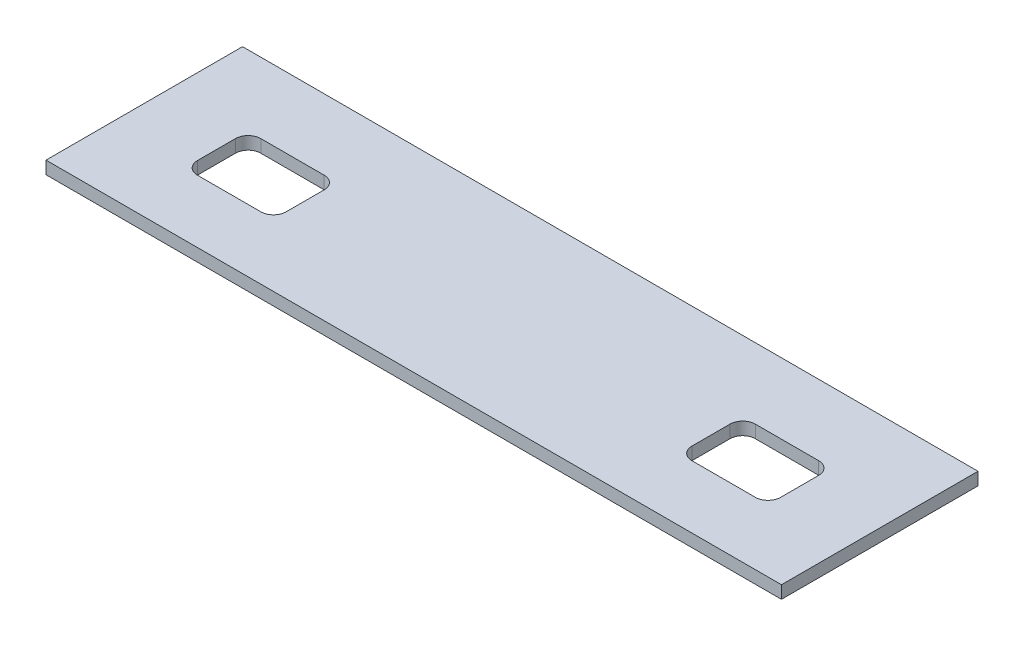
ISO-10303-21;
HEADER;
FILE_DESCRIPTION(('STEP AP214'),'2;1');
FILE_NAME('part.step','',(''),(''),'','','');
FILE_SCHEMA(('AUTOMOTIVE_DESIGN { 1 0 10303 214 1 1 1 1 }'));
ENDSEC;
DATA;
#1=APPLICATION_CONTEXT('core data for automotive mechanical design processes');
#2=APPLICATION_PROTOCOL_DEFINITION('international standard','automotive_design',2000,#1);
#3=PRODUCT_CONTEXT('',#1,'mechanical');
#4=PRODUCT('Part','Part','',(#3));
#5=PRODUCT_RELATED_PRODUCT_CATEGORY('part','',(#4));
#6=PRODUCT_DEFINITION_FORMATION('','',#4);
#7=PRODUCT_DEFINITION_CONTEXT('part definition',#1,'design');
#8=PRODUCT_DEFINITION('design','',#6,#7);
#9=PRODUCT_DEFINITION_SHAPE('','',#8);
#10=(LENGTH_UNIT() NAMED_UNIT(*) SI_UNIT(.MILLI.,.METRE.));
#11=(NAMED_UNIT(*) PLANE_ANGLE_UNIT() SI_UNIT($,.RADIAN.));
#12=(NAMED_UNIT(*) SI_UNIT($,.STERADIAN.) SOLID_ANGLE_UNIT());
#13=UNCERTAINTY_MEASURE_WITH_UNIT(LENGTH_MEASURE(1.E-05),#10,'distance_accuracy_value','');
#14=(GEOMETRIC_REPRESENTATION_CONTEXT(3) GLOBAL_UNCERTAINTY_ASSIGNED_CONTEXT((#13)) GLOBAL_UNIT_ASSIGNED_CONTEXT((#10,
#11,#12)) REPRESENTATION_CONTEXT('',''));
#15=CARTESIAN_POINT('',(0.,0.,0.));
#16=DIRECTION('',(0.,0.,1.));
#17=DIRECTION('',(1.,0.,0.));
#18=AXIS2_PLACEMENT_3D('',#15,#16,#17);
#19=CARTESIAN_POINT('',(0.,10.,0.));
#20=DIRECTION('',(1.,0.,0.));
#21=DIRECTION('',(0.,0.,-1.));
#22=AXIS2_PLACEMENT_3D('',#19,#20,#21);
#23=PLANE('',#22);
#24=DIRECTION('',(0.,0.,1.));
#25=VECTOR('',#24,1.);
#26=CARTESIAN_POINT('',(0.,0.,0.));
#27=LINE('',#26,#25);
#28=CARTESIAN_POINT('',(0.,0.,-155.));
#29=VERTEX_POINT('',#28);
#30=CARTESIAN_POINT('',(0.,0.,0.));
#31=VERTEX_POINT('',#30);
#32=EDGE_CURVE('E288',#29,#31,#27,.T.);
#33=ORIENTED_EDGE('',*,*,#32,.T.);
#34=DIRECTION('',(0.,-1.,0.));
#35=VECTOR('',#34,1.);
#36=CARTESIAN_POINT('',(0.,10.,0.));
#37=LINE('',#36,#35);
#38=CARTESIAN_POINT('',(0.,10.,0.));
#39=VERTEX_POINT('',#38);
#40=EDGE_CURVE('E11',#39,#31,#37,.T.);
#41=ORIENTED_EDGE('',*,*,#40,.F.);
#42=DIRECTION('',(0.,0.,1.));
#43=VECTOR('',#42,1.);
#44=CARTESIAN_POINT('',(0.,10.,0.));
#45=LINE('',#44,#43);
#46=CARTESIAN_POINT('',(0.,10.,-155.));
#47=VERTEX_POINT('',#46);
#48=EDGE_CURVE('E303',#47,#39,#45,.T.);
#49=ORIENTED_EDGE('',*,*,#48,.F.);
#50=DIRECTION('',(0.,-1.,0.));
#51=VECTOR('',#50,1.);
#52=CARTESIAN_POINT('',(0.,10.,-155.));
#53=LINE('',#52,#51);
#54=EDGE_CURVE('E313',#47,#29,#53,.T.);
#55=ORIENTED_EDGE('',*,*,#54,.T.);
#56=EDGE_LOOP('',(#33,#41,#49,#55));
#57=FACE_BOUND('',#56,.T.);
#58=ADVANCED_FACE('F34',(#57),#23,.F.);
#59=CARTESIAN_POINT('',(0.,10.,0.));
#60=DIRECTION('',(0.,0.,-1.));
#61=DIRECTION('',(-1.,0.,0.));
#62=AXIS2_PLACEMENT_3D('',#59,#60,#61);
#63=PLANE('',#62);
#64=DIRECTION('',(1.,0.,0.));
#65=VECTOR('',#64,1.);
#66=CARTESIAN_POINT('',(0.,0.,0.));
#67=LINE('',#66,#65);
#68=CARTESIAN_POINT('',(580.,0.,0.));
#69=VERTEX_POINT('',#68);
#70=EDGE_CURVE('E316',#31,#69,#67,.T.);
#71=ORIENTED_EDGE('',*,*,#70,.T.);
#72=DIRECTION('',(0.,-1.,0.));
#73=VECTOR('',#72,1.);
#74=CARTESIAN_POINT('',(580.,10.,0.));
#75=LINE('',#74,#73);
#76=CARTESIAN_POINT('',(580.,10.,0.));
#77=VERTEX_POINT('',#76);
#78=EDGE_CURVE('E41',#77,#69,#75,.T.);
#79=ORIENTED_EDGE('',*,*,#78,.F.);
#80=DIRECTION('',(1.,0.,0.));
#81=VECTOR('',#80,1.);
#82=CARTESIAN_POINT('',(0.,10.,0.));
#83=LINE('',#82,#81);
#84=EDGE_CURVE('E306',#39,#77,#83,.T.);
#85=ORIENTED_EDGE('',*,*,#84,.F.);
#86=ORIENTED_EDGE('',*,*,#40,.T.);
#87=EDGE_LOOP('',(#71,#79,#85,#86));
#88=FACE_BOUND('',#87,.T.);
#89=ADVANCED_FACE('F345',(#88),#63,.F.);
#90=CARTESIAN_POINT('',(580.,10.,0.));
#91=DIRECTION('',(-1.,0.,0.));
#92=DIRECTION('',(0.,0.,1.));
#93=AXIS2_PLACEMENT_3D('',#90,#91,#92);
#94=PLANE('',#93);
#95=DIRECTION('',(0.,0.,-1.));
#96=VECTOR('',#95,1.);
#97=CARTESIAN_POINT('',(580.,0.,0.));
#98=LINE('',#97,#96);
#99=CARTESIAN_POINT('',(580.,0.,-155.));
#100=VERTEX_POINT('',#99);
#101=EDGE_CURVE('E318',#69,#100,#98,.T.);
#102=ORIENTED_EDGE('',*,*,#101,.T.);
#103=DIRECTION('',(0.,-1.,0.));
#104=VECTOR('',#103,1.);
#105=CARTESIAN_POINT('',(580.,10.,-155.));
#106=LINE('',#105,#104);
#107=CARTESIAN_POINT('',(580.,10.,-155.));
#108=VERTEX_POINT('',#107);
#109=EDGE_CURVE('E323',#108,#100,#106,.T.);
#110=ORIENTED_EDGE('',*,*,#109,.F.);
#111=DIRECTION('',(0.,0.,-1.));
#112=VECTOR('',#111,1.);
#113=CARTESIAN_POINT('',(580.,10.,0.));
#114=LINE('',#113,#112);
#115=EDGE_CURVE('E309',#77,#108,#114,.T.);
#116=ORIENTED_EDGE('',*,*,#115,.F.);
#117=ORIENTED_EDGE('',*,*,#78,.T.);
#118=EDGE_LOOP('',(#102,#110,#116,#117));
#119=FACE_BOUND('',#118,.T.);
#120=ADVANCED_FACE('F330',(#119),#94,.F.);
#121=CARTESIAN_POINT('',(0.,10.,-155.));
#122=DIRECTION('',(0.,0.,1.));
#123=DIRECTION('',(1.,0.,0.));
#124=AXIS2_PLACEMENT_3D('',#121,#122,#123);
#125=PLANE('',#124);
#126=DIRECTION('',(-1.,0.,0.));
#127=VECTOR('',#126,1.);
#128=CARTESIAN_POINT('',(0.,0.,-155.));
#129=LINE('',#128,#127);
#130=EDGE_CURVE('E307',#100,#29,#129,.T.);
#131=ORIENTED_EDGE('',*,*,#130,.T.);
#132=ORIENTED_EDGE('',*,*,#54,.F.);
#133=DIRECTION('',(-1.,0.,0.));
#134=VECTOR('',#133,1.);
#135=CARTESIAN_POINT('',(0.,10.,-155.));
#136=LINE('',#135,#134);
#137=EDGE_CURVE('E311',#108,#47,#136,.T.);
#138=ORIENTED_EDGE('',*,*,#137,.F.);
#139=ORIENTED_EDGE('',*,*,#109,.T.);
#140=EDGE_LOOP('',(#131,#132,#138,#139));
#141=FACE_BOUND('',#140,.T.);
#142=ADVANCED_FACE('F338',(#141),#125,.F.);
#143=CARTESIAN_POINT('',(0.,10.,0.));
#144=DIRECTION('',(0.,-1.,0.));
#145=DIRECTION('',(0.,0.,-1.));
#146=AXIS2_PLACEMENT_3D('',#143,#144,#145);
#147=PLANE('',#146);
#148=DIRECTION('',(-1.,0.,0.));
#149=VECTOR('',#148,1.);
#150=CARTESIAN_POINT('',(70.0000000000006,10.,-99.4058928691466));
#151=LINE('',#150,#149);
#152=CARTESIAN_POINT('',(120.000000000001,10.,-99.4058928691466));
#153=VERTEX_POINT('',#152);
#154=CARTESIAN_POINT('',(70.0000000000006,10.,-99.4058928691466));
#155=VERTEX_POINT('',#154);
#156=EDGE_CURVE('E209',#153,#155,#151,.T.);
#157=ORIENTED_EDGE('',*,*,#156,.F.);
#158=CARTESIAN_POINT('',(120.000000000001,10.,-89.4058928691466));
#159=DIRECTION('',(0.,1.,0.));
#160=DIRECTION('',(0.,0.,-1.));
#161=AXIS2_PLACEMENT_3D('',#158,#159,#160);
#162=CIRCLE('',#161,9.99999999999999);
#163=CARTESIAN_POINT('',(130.000000000001,10.,-89.4058928691466));
#164=VERTEX_POINT('',#163);
#165=EDGE_CURVE('E48',#164,#153,#162,.T.);
#166=ORIENTED_EDGE('',*,*,#165,.F.);
#167=DIRECTION('',(0.,0.,-1.));
#168=VECTOR('',#167,1.);
#169=CARTESIAN_POINT('',(130.000000000001,10.,-89.4058928691466));
#170=LINE('',#169,#168);
#171=CARTESIAN_POINT('',(130.000000000001,10.,-59.4058928691466));
#172=VERTEX_POINT('',#171);
#173=EDGE_CURVE('E189',#172,#164,#170,.T.);
#174=ORIENTED_EDGE('',*,*,#173,.F.);
#175=CARTESIAN_POINT('',(120.000000000001,10.,-59.4058928691466));
#176=DIRECTION('',(0.,1.,0.));
#177=DIRECTION('',(0.,0.,-1.));
#178=AXIS2_PLACEMENT_3D('',#175,#176,#177);
#179=CIRCLE('',#178,9.99999999999999);
#180=CARTESIAN_POINT('',(120.000000000001,10.,-49.4058928691466));
#181=VERTEX_POINT('',#180);
#182=EDGE_CURVE('E192',#181,#172,#179,.T.);
#183=ORIENTED_EDGE('',*,*,#182,.F.);
#184=DIRECTION('',(1.,0.,0.));
#185=VECTOR('',#184,1.);
#186=CARTESIAN_POINT('',(70.0000000000006,10.,-49.4058928691466));
#187=LINE('',#186,#185);
#188=CARTESIAN_POINT('',(70.0000000000006,10.,-49.4058928691466));
#189=VERTEX_POINT('',#188);
#190=EDGE_CURVE('E220',#189,#181,#187,.T.);
#191=ORIENTED_EDGE('',*,*,#190,.F.);
#192=CARTESIAN_POINT('',(70.0000000000006,10.,-59.4058928691466));
#193=DIRECTION('',(0.,1.,0.));
#194=DIRECTION('',(0.,0.,-1.));
#195=AXIS2_PLACEMENT_3D('',#192,#193,#194);
#196=CIRCLE('',#195,10.);
#197=CARTESIAN_POINT('',(60.0000000000006,10.,-59.4058928691466));
#198=VERTEX_POINT('',#197);
#199=EDGE_CURVE('E217',#198,#189,#196,.T.);
#200=ORIENTED_EDGE('',*,*,#199,.F.);
#201=DIRECTION('',(0.,0.,1.));
#202=VECTOR('',#201,1.);
#203=CARTESIAN_POINT('',(60.0000000000006,10.,-89.4058928691466));
#204=LINE('',#203,#202);
#205=CARTESIAN_POINT('',(60.0000000000006,10.,-89.4058928691466));
#206=VERTEX_POINT('',#205);
#207=EDGE_CURVE('E214',#206,#198,#204,.T.);
#208=ORIENTED_EDGE('',*,*,#207,.F.);
#209=CARTESIAN_POINT('',(70.0000000000006,10.,-89.4058928691466));
#210=DIRECTION('',(0.,1.,0.));
#211=DIRECTION('',(0.,0.,-1.));
#212=AXIS2_PLACEMENT_3D('',#209,#210,#211);
#213=CIRCLE('',#212,10.);
#214=EDGE_CURVE('E211',#155,#206,#213,.T.);
#215=ORIENTED_EDGE('',*,*,#214,.F.);
#216=EDGE_LOOP('',(#157,#166,#174,#183,#191,#200,#208,#215));
#217=FACE_BOUND('',#216,.T.);
#218=DIRECTION('',(-1.,0.,0.));
#219=VECTOR('',#218,1.);
#220=CARTESIAN_POINT('',(460.000000000001,10.,-99.4058928691465));
#221=LINE('',#220,#219);
#222=CARTESIAN_POINT('',(510.000000000001,10.,-99.4058928691465));
#223=VERTEX_POINT('',#222);
#224=CARTESIAN_POINT('',(460.000000000001,10.,-99.4058928691465));
#225=VERTEX_POINT('',#224);
#226=EDGE_CURVE('E266',#223,#225,#221,.T.);
#227=ORIENTED_EDGE('',*,*,#226,.F.);
#228=CARTESIAN_POINT('',(510.000000000001,10.,-89.4058928691465));
#229=DIRECTION('',(0.,1.,0.));
#230=DIRECTION('',(0.,0.,-1.));
#231=AXIS2_PLACEMENT_3D('',#228,#229,#230);
#232=CIRCLE('',#231,10.);
#233=CARTESIAN_POINT('',(520.000000000001,10.,-89.4058928691465));
#234=VERTEX_POINT('',#233);
#235=EDGE_CURVE('E227',#234,#223,#232,.T.);
#236=ORIENTED_EDGE('',*,*,#235,.F.);
#237=DIRECTION('',(0.,0.,-1.));
#238=VECTOR('',#237,1.);
#239=CARTESIAN_POINT('',(520.000000000001,10.,-89.4058928691465));
#240=LINE('',#239,#238);
#241=CARTESIAN_POINT('',(520.000000000001,10.,-59.4058928691465));
#242=VERTEX_POINT('',#241);
#243=EDGE_CURVE('E243',#242,#234,#240,.T.);
#244=ORIENTED_EDGE('',*,*,#243,.F.);
#245=CARTESIAN_POINT('',(510.000000000001,10.,-59.4058928691465));
#246=DIRECTION('',(0.,1.,0.));
#247=DIRECTION('',(0.,0.,-1.));
#248=AXIS2_PLACEMENT_3D('',#245,#246,#247);
#249=CIRCLE('',#248,10.);
#250=CARTESIAN_POINT('',(510.000000000001,10.,-49.4058928691465));
#251=VERTEX_POINT('',#250);
#252=EDGE_CURVE('E281',#251,#242,#249,.T.);
#253=ORIENTED_EDGE('',*,*,#252,.F.);
#254=DIRECTION('',(1.,0.,0.));
#255=VECTOR('',#254,1.);
#256=CARTESIAN_POINT('',(460.000000000001,10.,-49.4058928691465));
#257=LINE('',#256,#255);
#258=CARTESIAN_POINT('',(460.000000000001,10.,-49.4058928691465));
#259=VERTEX_POINT('',#258);
#260=EDGE_CURVE('E278',#259,#251,#257,.T.);
#261=ORIENTED_EDGE('',*,*,#260,.F.);
#262=CARTESIAN_POINT('',(460.000000000001,10.,-59.4058928691465));
#263=DIRECTION('',(0.,1.,0.));
#264=DIRECTION('',(0.,0.,-1.));
#265=AXIS2_PLACEMENT_3D('',#262,#263,#264);
#266=CIRCLE('',#265,10.);
#267=CARTESIAN_POINT('',(450.000000000001,10.,-59.4058928691465));
#268=VERTEX_POINT('',#267);
#269=EDGE_CURVE('E275',#268,#259,#266,.T.);
#270=ORIENTED_EDGE('',*,*,#269,.F.);
#271=DIRECTION('',(0.,0.,1.));
#272=VECTOR('',#271,1.);
#273=CARTESIAN_POINT('',(450.000000000001,10.,-89.4058928691465));
#274=LINE('',#273,#272);
#275=CARTESIAN_POINT('',(450.000000000001,10.,-89.4058928691465));
#276=VERTEX_POINT('',#275);
#277=EDGE_CURVE('E272',#276,#268,#274,.T.);
#278=ORIENTED_EDGE('',*,*,#277,.F.);
#279=CARTESIAN_POINT('',(460.000000000001,10.,-89.4058928691465));
#280=DIRECTION('',(0.,1.,0.));
#281=DIRECTION('',(0.,0.,-1.));
#282=AXIS2_PLACEMENT_3D('',#279,#280,#281);
#283=CIRCLE('',#282,10.);
#284=EDGE_CURVE('E269',#225,#276,#283,.T.);
#285=ORIENTED_EDGE('',*,*,#284,.F.);
#286=EDGE_LOOP('',(#227,#236,#244,#253,#261,#270,#278,#285));
#287=FACE_BOUND('',#286,.T.);
#288=ORIENTED_EDGE('',*,*,#48,.T.);
#289=ORIENTED_EDGE('',*,*,#84,.T.);
#290=ORIENTED_EDGE('',*,*,#115,.T.);
#291=ORIENTED_EDGE('',*,*,#137,.T.);
#292=EDGE_LOOP('',(#288,#289,#290,#291));
#293=FACE_BOUND('',#292,.T.);
#294=ADVANCED_FACE('F344',(#217,#287,#293),#147,.F.);
#295=CARTESIAN_POINT('',(0.,0.,0.));
#296=DIRECTION('',(0.,-1.,0.));
#297=DIRECTION('',(0.,0.,-1.));
#298=AXIS2_PLACEMENT_3D('',#295,#296,#297);
#299=PLANE('',#298);
#300=CARTESIAN_POINT('',(120.000000000001,0.,-89.4058928691466));
#301=DIRECTION('',(0.,1.,0.));
#302=DIRECTION('',(0.,0.,-1.));
#303=AXIS2_PLACEMENT_3D('',#300,#301,#302);
#304=CIRCLE('',#303,9.99999999999999);
#305=CARTESIAN_POINT('',(130.000000000001,0.,-89.4058928691466));
#306=VERTEX_POINT('',#305);
#307=CARTESIAN_POINT('',(120.000000000001,0.,-99.4058928691466));
#308=VERTEX_POINT('',#307);
#309=EDGE_CURVE('E172',#306,#308,#304,.T.);
#310=ORIENTED_EDGE('',*,*,#309,.T.);
#311=DIRECTION('',(-1.,0.,0.));
#312=VECTOR('',#311,1.);
#313=CARTESIAN_POINT('',(70.0000000000006,0.,-99.4058928691466));
#314=LINE('',#313,#312);
#315=CARTESIAN_POINT('',(70.0000000000006,0.,-99.4058928691466));
#316=VERTEX_POINT('',#315);
#317=EDGE_CURVE('E181',#308,#316,#314,.T.);
#318=ORIENTED_EDGE('',*,*,#317,.T.);
#319=CARTESIAN_POINT('',(70.0000000000006,0.,-89.4058928691466));
#320=DIRECTION('',(0.,1.,0.));
#321=DIRECTION('',(0.,0.,-1.));
#322=AXIS2_PLACEMENT_3D('',#319,#320,#321);
#323=CIRCLE('',#322,10.);
#324=CARTESIAN_POINT('',(60.0000000000006,0.,-89.4058928691466));
#325=VERTEX_POINT('',#324);
#326=EDGE_CURVE('E56',#316,#325,#323,.T.);
#327=ORIENTED_EDGE('',*,*,#326,.T.);
#328=DIRECTION('',(0.,0.,1.));
#329=VECTOR('',#328,1.);
#330=CARTESIAN_POINT('',(60.0000000000006,0.,-89.4058928691466));
#331=LINE('',#330,#329);
#332=CARTESIAN_POINT('',(60.0000000000006,0.,-59.4058928691466));
#333=VERTEX_POINT('',#332);
#334=EDGE_CURVE('E196',#325,#333,#331,.T.);
#335=ORIENTED_EDGE('',*,*,#334,.T.);
#336=CARTESIAN_POINT('',(70.0000000000006,0.,-59.4058928691466));
#337=DIRECTION('',(0.,1.,0.));
#338=DIRECTION('',(0.,0.,-1.));
#339=AXIS2_PLACEMENT_3D('',#336,#337,#338);
#340=CIRCLE('',#339,10.);
#341=CARTESIAN_POINT('',(70.0000000000006,0.,-49.4058928691466));
#342=VERTEX_POINT('',#341);
#343=EDGE_CURVE('E199',#333,#342,#340,.T.);
#344=ORIENTED_EDGE('',*,*,#343,.T.);
#345=DIRECTION('',(1.,0.,0.));
#346=VECTOR('',#345,1.);
#347=CARTESIAN_POINT('',(70.0000000000006,0.,-49.4058928691466));
#348=LINE('',#347,#346);
#349=CARTESIAN_POINT('',(120.000000000001,0.,-49.4058928691466));
#350=VERTEX_POINT('',#349);
#351=EDGE_CURVE('E202',#342,#350,#348,.T.);
#352=ORIENTED_EDGE('',*,*,#351,.T.);
#353=CARTESIAN_POINT('',(120.000000000001,0.,-59.4058928691466));
#354=DIRECTION('',(0.,1.,0.));
#355=DIRECTION('',(0.,0.,-1.));
#356=AXIS2_PLACEMENT_3D('',#353,#354,#355);
#357=CIRCLE('',#356,9.99999999999999);
#358=CARTESIAN_POINT('',(130.000000000001,0.,-59.4058928691466));
#359=VERTEX_POINT('',#358);
#360=EDGE_CURVE('E205',#350,#359,#357,.T.);
#361=ORIENTED_EDGE('',*,*,#360,.T.);
#362=DIRECTION('',(0.,0.,-1.));
#363=VECTOR('',#362,1.);
#364=CARTESIAN_POINT('',(130.000000000001,0.,-89.4058928691466));
#365=LINE('',#364,#363);
#366=EDGE_CURVE('E178',#359,#306,#365,.T.);
#367=ORIENTED_EDGE('',*,*,#366,.T.);
#368=EDGE_LOOP('',(#310,#318,#327,#335,#344,#352,#361,#367));
#369=FACE_BOUND('',#368,.T.);
#370=CARTESIAN_POINT('',(510.000000000001,0.,-89.4058928691465));
#371=DIRECTION('',(0.,1.,0.));
#372=DIRECTION('',(0.,0.,-1.));
#373=AXIS2_PLACEMENT_3D('',#370,#371,#372);
#374=CIRCLE('',#373,10.);
#375=CARTESIAN_POINT('',(520.000000000001,0.,-89.4058928691465));
#376=VERTEX_POINT('',#375);
#377=CARTESIAN_POINT('',(510.000000000001,0.,-99.4058928691465));
#378=VERTEX_POINT('',#377);
#379=EDGE_CURVE('E239',#376,#378,#374,.T.);
#380=ORIENTED_EDGE('',*,*,#379,.T.);
#381=DIRECTION('',(-1.,0.,0.));
#382=VECTOR('',#381,1.);
#383=CARTESIAN_POINT('',(460.000000000001,0.,-99.4058928691465));
#384=LINE('',#383,#382);
#385=CARTESIAN_POINT('',(460.000000000001,0.,-99.4058928691465));
#386=VERTEX_POINT('',#385);
#387=EDGE_CURVE('E242',#378,#386,#384,.T.);
#388=ORIENTED_EDGE('',*,*,#387,.T.);
#389=CARTESIAN_POINT('',(460.000000000001,0.,-89.4058928691465));
#390=DIRECTION('',(0.,1.,0.));
#391=DIRECTION('',(0.,0.,-1.));
#392=AXIS2_PLACEMENT_3D('',#389,#390,#391);
#393=CIRCLE('',#392,10.);
#394=CARTESIAN_POINT('',(450.000000000001,0.,-89.4058928691465));
#395=VERTEX_POINT('',#394);
#396=EDGE_CURVE('E246',#386,#395,#393,.T.);
#397=ORIENTED_EDGE('',*,*,#396,.T.);
#398=DIRECTION('',(0.,0.,1.));
#399=VECTOR('',#398,1.);
#400=CARTESIAN_POINT('',(450.000000000001,0.,-89.4058928691465));
#401=LINE('',#400,#399);
#402=CARTESIAN_POINT('',(450.000000000001,0.,-59.4058928691465));
#403=VERTEX_POINT('',#402);
#404=EDGE_CURVE('E249',#395,#403,#401,.T.);
#405=ORIENTED_EDGE('',*,*,#404,.T.);
#406=CARTESIAN_POINT('',(460.000000000001,0.,-59.4058928691465));
#407=DIRECTION('',(0.,1.,0.));
#408=DIRECTION('',(0.,0.,-1.));
#409=AXIS2_PLACEMENT_3D('',#406,#407,#408);
#410=CIRCLE('',#409,10.);
#411=CARTESIAN_POINT('',(460.000000000001,0.,-49.4058928691465));
#412=VERTEX_POINT('',#411);
#413=EDGE_CURVE('E252',#403,#412,#410,.T.);
#414=ORIENTED_EDGE('',*,*,#413,.T.);
#415=DIRECTION('',(1.,0.,0.));
#416=VECTOR('',#415,1.);
#417=CARTESIAN_POINT('',(460.000000000001,0.,-49.4058928691465));
#418=LINE('',#417,#416);
#419=CARTESIAN_POINT('',(510.000000000001,0.,-49.4058928691465));
#420=VERTEX_POINT('',#419);
#421=EDGE_CURVE('E255',#412,#420,#418,.T.);
#422=ORIENTED_EDGE('',*,*,#421,.T.);
#423=CARTESIAN_POINT('',(510.000000000001,0.,-59.4058928691465));
#424=DIRECTION('',(0.,1.,0.));
#425=DIRECTION('',(0.,0.,-1.));
#426=AXIS2_PLACEMENT_3D('',#423,#424,#425);
#427=CIRCLE('',#426,10.);
#428=CARTESIAN_POINT('',(520.000000000001,0.,-59.4058928691465));
#429=VERTEX_POINT('',#428);
#430=EDGE_CURVE('E258',#420,#429,#427,.T.);
#431=ORIENTED_EDGE('',*,*,#430,.T.);
#432=DIRECTION('',(0.,0.,-1.));
#433=VECTOR('',#432,1.);
#434=CARTESIAN_POINT('',(520.000000000001,0.,-89.4058928691465));
#435=LINE('',#434,#433);
#436=EDGE_CURVE('E261',#429,#376,#435,.T.);
#437=ORIENTED_EDGE('',*,*,#436,.T.);
#438=EDGE_LOOP('',(#380,#388,#397,#405,#414,#422,#431,#437));
#439=FACE_BOUND('',#438,.T.);
#440=ORIENTED_EDGE('',*,*,#32,.F.);
#441=ORIENTED_EDGE('',*,*,#130,.F.);
#442=ORIENTED_EDGE('',*,*,#101,.F.);
#443=ORIENTED_EDGE('',*,*,#70,.F.);
#444=EDGE_LOOP('',(#440,#441,#442,#443));
#445=FACE_BOUND('',#444,.T.);
#446=ADVANCED_FACE('F185',(#369,#439,#445),#299,.T.);
#447=CARTESIAN_POINT('',(510.000000000001,0.,-89.4058928691465));
#448=DIRECTION('',(0.,1.,0.));
#449=DIRECTION('',(0.,0.,1.));
#450=AXIS2_PLACEMENT_3D('',#447,#448,#449);
#451=CYLINDRICAL_SURFACE('',#450,10.);
#452=ORIENTED_EDGE('',*,*,#235,.T.);
#453=DIRECTION('',(0.,1.,0.));
#454=VECTOR('',#453,1.);
#455=CARTESIAN_POINT('',(510.000000000001,0.,-99.4058928691465));
#456=LINE('',#455,#454);
#457=EDGE_CURVE('E264',#378,#223,#456,.T.);
#458=ORIENTED_EDGE('',*,*,#457,.F.);
#459=ORIENTED_EDGE('',*,*,#379,.F.);
#460=DIRECTION('',(0.,1.,0.));
#461=VECTOR('',#460,1.);
#462=CARTESIAN_POINT('',(520.000000000001,0.,-89.4058928691465));
#463=LINE('',#462,#461);
#464=EDGE_CURVE('E286',#376,#234,#463,.T.);
#465=ORIENTED_EDGE('',*,*,#464,.T.);
#466=EDGE_LOOP('',(#452,#458,#459,#465));
#467=FACE_BOUND('',#466,.T.);
#468=ADVANCED_FACE('F357',(#467),#451,.F.);
#469=CARTESIAN_POINT('',(520.000000000001,0.,-89.4058928691465));
#470=DIRECTION('',(1.,0.,0.));
#471=DIRECTION('',(0.,0.,-1.));
#472=AXIS2_PLACEMENT_3D('',#469,#470,#471);
#473=PLANE('',#472);
#474=ORIENTED_EDGE('',*,*,#243,.T.);
#475=ORIENTED_EDGE('',*,*,#464,.F.);
#476=ORIENTED_EDGE('',*,*,#436,.F.);
#477=DIRECTION('',(0.,1.,0.));
#478=VECTOR('',#477,1.);
#479=CARTESIAN_POINT('',(520.000000000001,0.,-59.4058928691465));
#480=LINE('',#479,#478);
#481=EDGE_CURVE('E289',#429,#242,#480,.T.);
#482=ORIENTED_EDGE('',*,*,#481,.T.);
#483=EDGE_LOOP('',(#474,#475,#476,#482));
#484=FACE_BOUND('',#483,.T.);
#485=ADVANCED_FACE('F363',(#484),#473,.F.);
#486=CARTESIAN_POINT('',(510.000000000001,0.,-59.4058928691465));
#487=DIRECTION('',(0.,1.,0.));
#488=DIRECTION('',(0.,0.,1.));
#489=AXIS2_PLACEMENT_3D('',#486,#487,#488);
#490=CYLINDRICAL_SURFACE('',#489,10.);
#491=ORIENTED_EDGE('',*,*,#252,.T.);
#492=ORIENTED_EDGE('',*,*,#481,.F.);
#493=ORIENTED_EDGE('',*,*,#430,.F.);
#494=DIRECTION('',(0.,1.,0.));
#495=VECTOR('',#494,1.);
#496=CARTESIAN_POINT('',(510.000000000001,0.,-49.4058928691465));
#497=LINE('',#496,#495);
#498=EDGE_CURVE('E291',#420,#251,#497,.T.);
#499=ORIENTED_EDGE('',*,*,#498,.T.);
#500=EDGE_LOOP('',(#491,#492,#493,#499));
#501=FACE_BOUND('',#500,.T.);
#502=ADVANCED_FACE('F384',(#501),#490,.F.);
#503=CARTESIAN_POINT('',(460.000000000001,0.,-49.4058928691465));
#504=DIRECTION('',(0.,0.,1.));
#505=DIRECTION('',(1.,0.,0.));
#506=AXIS2_PLACEMENT_3D('',#503,#504,#505);
#507=PLANE('',#506);
#508=ORIENTED_EDGE('',*,*,#260,.T.);
#509=ORIENTED_EDGE('',*,*,#498,.F.);
#510=ORIENTED_EDGE('',*,*,#421,.F.);
#511=DIRECTION('',(0.,1.,0.));
#512=VECTOR('',#511,1.);
#513=CARTESIAN_POINT('',(460.000000000001,0.,-49.4058928691465));
#514=LINE('',#513,#512);
#515=EDGE_CURVE('E293',#412,#259,#514,.T.);
#516=ORIENTED_EDGE('',*,*,#515,.T.);
#517=EDGE_LOOP('',(#508,#509,#510,#516));
#518=FACE_BOUND('',#517,.T.);
#519=ADVANCED_FACE('F380',(#518),#507,.F.);
#520=CARTESIAN_POINT('',(460.000000000001,0.,-59.4058928691465));
#521=DIRECTION('',(0.,1.,0.));
#522=DIRECTION('',(0.,0.,1.));
#523=AXIS2_PLACEMENT_3D('',#520,#521,#522);
#524=CYLINDRICAL_SURFACE('',#523,10.);
#525=ORIENTED_EDGE('',*,*,#269,.T.);
#526=ORIENTED_EDGE('',*,*,#515,.F.);
#527=ORIENTED_EDGE('',*,*,#413,.F.);
#528=DIRECTION('',(0.,1.,0.));
#529=VECTOR('',#528,1.);
#530=CARTESIAN_POINT('',(450.000000000001,0.,-59.4058928691465));
#531=LINE('',#530,#529);
#532=EDGE_CURVE('E295',#403,#268,#531,.T.);
#533=ORIENTED_EDGE('',*,*,#532,.T.);
#534=EDGE_LOOP('',(#525,#526,#527,#533));
#535=FACE_BOUND('',#534,.T.);
#536=ADVANCED_FACE('F376',(#535),#524,.F.);
#537=CARTESIAN_POINT('',(450.000000000001,0.,-89.4058928691465));
#538=DIRECTION('',(-1.,0.,0.));
#539=DIRECTION('',(0.,0.,1.));
#540=AXIS2_PLACEMENT_3D('',#537,#538,#539);
#541=PLANE('',#540);
#542=ORIENTED_EDGE('',*,*,#277,.T.);
#543=ORIENTED_EDGE('',*,*,#532,.F.);
#544=ORIENTED_EDGE('',*,*,#404,.F.);
#545=DIRECTION('',(0.,1.,0.));
#546=VECTOR('',#545,1.);
#547=CARTESIAN_POINT('',(450.000000000001,0.,-89.4058928691465));
#548=LINE('',#547,#546);
#549=EDGE_CURVE('E297',#395,#276,#548,.T.);
#550=ORIENTED_EDGE('',*,*,#549,.T.);
#551=EDGE_LOOP('',(#542,#543,#544,#550));
#552=FACE_BOUND('',#551,.T.);
#553=ADVANCED_FACE('F372',(#552),#541,.F.);
#554=CARTESIAN_POINT('',(460.000000000001,0.,-89.4058928691465));
#555=DIRECTION('',(0.,1.,0.));
#556=DIRECTION('',(0.,0.,1.));
#557=AXIS2_PLACEMENT_3D('',#554,#555,#556);
#558=CYLINDRICAL_SURFACE('',#557,10.);
#559=ORIENTED_EDGE('',*,*,#284,.T.);
#560=ORIENTED_EDGE('',*,*,#549,.F.);
#561=ORIENTED_EDGE('',*,*,#396,.F.);
#562=DIRECTION('',(0.,1.,0.));
#563=VECTOR('',#562,1.);
#564=CARTESIAN_POINT('',(460.000000000001,0.,-99.4058928691465));
#565=LINE('',#564,#563);
#566=EDGE_CURVE('E299',#386,#225,#565,.T.);
#567=ORIENTED_EDGE('',*,*,#566,.T.);
#568=EDGE_LOOP('',(#559,#560,#561,#567));
#569=FACE_BOUND('',#568,.T.);
#570=ADVANCED_FACE('F368',(#569),#558,.F.);
#571=CARTESIAN_POINT('',(460.000000000001,0.,-99.4058928691465));
#572=DIRECTION('',(0.,0.,-1.));
#573=DIRECTION('',(-1.,0.,0.));
#574=AXIS2_PLACEMENT_3D('',#571,#572,#573);
#575=PLANE('',#574);
#576=ORIENTED_EDGE('',*,*,#226,.T.);
#577=ORIENTED_EDGE('',*,*,#566,.F.);
#578=ORIENTED_EDGE('',*,*,#387,.F.);
#579=ORIENTED_EDGE('',*,*,#457,.T.);
#580=EDGE_LOOP('',(#576,#577,#578,#579));
#581=FACE_BOUND('',#580,.T.);
#582=ADVANCED_FACE('F365',(#581),#575,.F.);
#583=CARTESIAN_POINT('',(120.000000000001,0.,-89.4058928691466));
#584=DIRECTION('',(0.,1.,0.));
#585=DIRECTION('',(0.,0.,1.));
#586=AXIS2_PLACEMENT_3D('',#583,#584,#585);
#587=CYLINDRICAL_SURFACE('',#586,9.99999999999999);
#588=ORIENTED_EDGE('',*,*,#165,.T.);
#589=DIRECTION('',(0.,1.,0.));
#590=VECTOR('',#589,1.);
#591=CARTESIAN_POINT('',(120.000000000001,0.,-99.4058928691466));
#592=LINE('',#591,#590);
#593=EDGE_CURVE('E168',#308,#153,#592,.T.);
#594=ORIENTED_EDGE('',*,*,#593,.F.);
#595=ORIENTED_EDGE('',*,*,#309,.F.);
#596=DIRECTION('',(0.,1.,0.));
#597=VECTOR('',#596,1.);
#598=CARTESIAN_POINT('',(130.000000000001,0.,-89.4058928691466));
#599=LINE('',#598,#597);
#600=EDGE_CURVE('E225',#306,#164,#599,.T.);
#601=ORIENTED_EDGE('',*,*,#600,.T.);
#602=EDGE_LOOP('',(#588,#594,#595,#601));
#603=FACE_BOUND('',#602,.T.);
#604=ADVANCED_FACE('F170',(#603),#587,.F.);
#605=CARTESIAN_POINT('',(130.000000000001,0.,-89.4058928691466));
#606=DIRECTION('',(1.,0.,0.));
#607=DIRECTION('',(0.,0.,-1.));
#608=AXIS2_PLACEMENT_3D('',#605,#606,#607);
#609=PLANE('',#608);
#610=ORIENTED_EDGE('',*,*,#173,.T.);
#611=ORIENTED_EDGE('',*,*,#600,.F.);
#612=ORIENTED_EDGE('',*,*,#366,.F.);
#613=DIRECTION('',(0.,1.,0.));
#614=VECTOR('',#613,1.);
#615=CARTESIAN_POINT('',(130.000000000001,0.,-59.4058928691466));
#616=LINE('',#615,#614);
#617=EDGE_CURVE('E228',#359,#172,#616,.T.);
#618=ORIENTED_EDGE('',*,*,#617,.T.);
#619=EDGE_LOOP('',(#610,#611,#612,#618));
#620=FACE_BOUND('',#619,.T.);
#621=ADVANCED_FACE('F394',(#620),#609,.F.);
#622=CARTESIAN_POINT('',(120.000000000001,0.,-59.4058928691466));
#623=DIRECTION('',(0.,1.,0.));
#624=DIRECTION('',(0.,0.,1.));
#625=AXIS2_PLACEMENT_3D('',#622,#623,#624);
#626=CYLINDRICAL_SURFACE('',#625,9.99999999999999);
#627=ORIENTED_EDGE('',*,*,#182,.T.);
#628=ORIENTED_EDGE('',*,*,#617,.F.);
#629=ORIENTED_EDGE('',*,*,#360,.F.);
#630=DIRECTION('',(0.,1.,0.));
#631=VECTOR('',#630,1.);
#632=CARTESIAN_POINT('',(120.000000000001,0.,-49.4058928691466));
#633=LINE('',#632,#631);
#634=EDGE_CURVE('E230',#350,#181,#633,.T.);
#635=ORIENTED_EDGE('',*,*,#634,.T.);
#636=EDGE_LOOP('',(#627,#628,#629,#635));
#637=FACE_BOUND('',#636,.T.);
#638=ADVANCED_FACE('F411',(#637),#626,.F.);
#639=CARTESIAN_POINT('',(70.0000000000006,0.,-49.4058928691466));
#640=DIRECTION('',(0.,0.,1.));
#641=DIRECTION('',(1.,0.,0.));
#642=AXIS2_PLACEMENT_3D('',#639,#640,#641);
#643=PLANE('',#642);
#644=ORIENTED_EDGE('',*,*,#190,.T.);
#645=ORIENTED_EDGE('',*,*,#634,.F.);
#646=ORIENTED_EDGE('',*,*,#351,.F.);
#647=DIRECTION('',(0.,1.,0.));
#648=VECTOR('',#647,1.);
#649=CARTESIAN_POINT('',(70.0000000000006,0.,-49.4058928691466));
#650=LINE('',#649,#648);
#651=EDGE_CURVE('E232',#342,#189,#650,.T.);
#652=ORIENTED_EDGE('',*,*,#651,.T.);
#653=EDGE_LOOP('',(#644,#645,#646,#652));
#654=FACE_BOUND('',#653,.T.);
#655=ADVANCED_FACE('F407',(#654),#643,.F.);
#656=CARTESIAN_POINT('',(70.0000000000006,0.,-59.4058928691466));
#657=DIRECTION('',(0.,1.,0.));
#658=DIRECTION('',(0.,0.,1.));
#659=AXIS2_PLACEMENT_3D('',#656,#657,#658);
#660=CYLINDRICAL_SURFACE('',#659,10.);
#661=ORIENTED_EDGE('',*,*,#199,.T.);
#662=ORIENTED_EDGE('',*,*,#651,.F.);
#663=ORIENTED_EDGE('',*,*,#343,.F.);
#664=DIRECTION('',(0.,1.,0.));
#665=VECTOR('',#664,1.);
#666=CARTESIAN_POINT('',(60.0000000000006,0.,-59.4058928691466));
#667=LINE('',#666,#665);
#668=EDGE_CURVE('E234',#333,#198,#667,.T.);
#669=ORIENTED_EDGE('',*,*,#668,.T.);
#670=EDGE_LOOP('',(#661,#662,#663,#669));
#671=FACE_BOUND('',#670,.T.);
#672=ADVANCED_FACE('F403',(#671),#660,.F.);
#673=CARTESIAN_POINT('',(60.0000000000006,0.,-89.4058928691466));
#674=DIRECTION('',(-1.,0.,0.));
#675=DIRECTION('',(0.,0.,1.));
#676=AXIS2_PLACEMENT_3D('',#673,#674,#675);
#677=PLANE('',#676);
#678=ORIENTED_EDGE('',*,*,#207,.T.);
#679=ORIENTED_EDGE('',*,*,#668,.F.);
#680=ORIENTED_EDGE('',*,*,#334,.F.);
#681=DIRECTION('',(0.,1.,0.));
#682=VECTOR('',#681,1.);
#683=CARTESIAN_POINT('',(60.0000000000006,0.,-89.4058928691466));
#684=LINE('',#683,#682);
#685=EDGE_CURVE('E236',#325,#206,#684,.T.);
#686=ORIENTED_EDGE('',*,*,#685,.T.);
#687=EDGE_LOOP('',(#678,#679,#680,#686));
#688=FACE_BOUND('',#687,.T.);
#689=ADVANCED_FACE('F400',(#688),#677,.F.);
#690=CARTESIAN_POINT('',(70.0000000000006,0.,-89.4058928691466));
#691=DIRECTION('',(0.,1.,0.));
#692=DIRECTION('',(0.,0.,1.));
#693=AXIS2_PLACEMENT_3D('',#690,#691,#692);
#694=CYLINDRICAL_SURFACE('',#693,10.);
#695=ORIENTED_EDGE('',*,*,#214,.T.);
#696=ORIENTED_EDGE('',*,*,#685,.F.);
#697=ORIENTED_EDGE('',*,*,#326,.F.);
#698=DIRECTION('',(0.,1.,0.));
#699=VECTOR('',#698,1.);
#700=CARTESIAN_POINT('',(70.0000000000006,0.,-99.4058928691466));
#701=LINE('',#700,#699);
#702=EDGE_CURVE('E177',#316,#155,#701,.T.);
#703=ORIENTED_EDGE('',*,*,#702,.T.);
#704=EDGE_LOOP('',(#695,#696,#697,#703));
#705=FACE_BOUND('',#704,.T.);
#706=ADVANCED_FACE('F397',(#705),#694,.F.);
#707=CARTESIAN_POINT('',(70.0000000000006,0.,-99.4058928691466));
#708=DIRECTION('',(0.,0.,-1.));
#709=DIRECTION('',(-1.,0.,0.));
#710=AXIS2_PLACEMENT_3D('',#707,#708,#709);
#711=PLANE('',#710);
#712=ORIENTED_EDGE('',*,*,#156,.T.);
#713=ORIENTED_EDGE('',*,*,#702,.F.);
#714=ORIENTED_EDGE('',*,*,#317,.F.);
#715=ORIENTED_EDGE('',*,*,#593,.T.);
#716=EDGE_LOOP('',(#712,#713,#714,#715));
#717=FACE_BOUND('',#716,.T.);
#718=ADVANCED_FACE('F182',(#717),#711,.F.);
#719=CLOSED_SHELL('',(#58,#89,#120,#142,#294,#446,#468,#485,#502,#519,#536,#553,#570,#582,#604,
#621,#638,#655,#672,#689,#706,#718));
#720=MANIFOLD_SOLID_BREP('B2',#719);
#721=ADVANCED_BREP_SHAPE_REPRESENTATION('',(#18,#720),#14);
#722=SHAPE_DEFINITION_REPRESENTATION(#9,#721);
ENDSEC;
END-ISO-10303-21;
